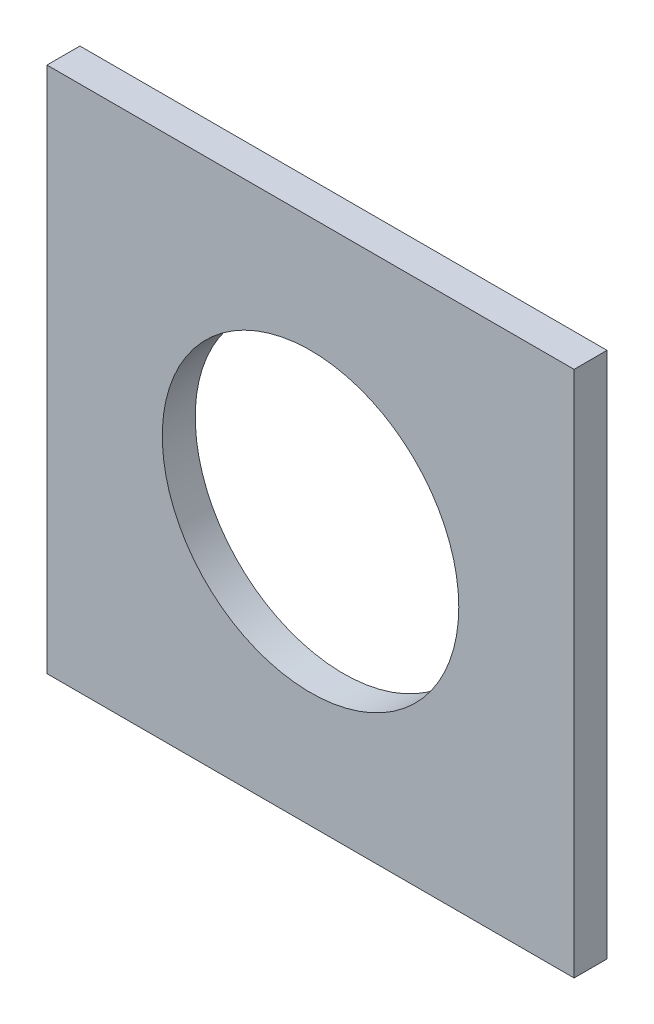
ISO-10303-21;
HEADER;
FILE_DESCRIPTION(('STEP AP214'),'2;1');
FILE_NAME('part.step','',(''),(''),'','','');
FILE_SCHEMA(('AUTOMOTIVE_DESIGN { 1 0 10303 214 1 1 1 1 }'));
ENDSEC;
DATA;
#1=APPLICATION_CONTEXT('core data for automotive mechanical design processes');
#2=APPLICATION_PROTOCOL_DEFINITION('international standard','automotive_design',2000,#1);
#3=PRODUCT_CONTEXT('',#1,'mechanical');
#4=PRODUCT('Part','Part','',(#3));
#5=PRODUCT_RELATED_PRODUCT_CATEGORY('part','',(#4));
#6=PRODUCT_DEFINITION_FORMATION('','',#4);
#7=PRODUCT_DEFINITION_CONTEXT('part definition',#1,'design');
#8=PRODUCT_DEFINITION('design','',#6,#7);
#9=PRODUCT_DEFINITION_SHAPE('','',#8);
#10=(LENGTH_UNIT() NAMED_UNIT(*) SI_UNIT(.MILLI.,.METRE.));
#11=(NAMED_UNIT(*) PLANE_ANGLE_UNIT() SI_UNIT($,.RADIAN.));
#12=(NAMED_UNIT(*) SI_UNIT($,.STERADIAN.) SOLID_ANGLE_UNIT());
#13=UNCERTAINTY_MEASURE_WITH_UNIT(LENGTH_MEASURE(1.E-05),#10,'distance_accuracy_value','');
#14=(GEOMETRIC_REPRESENTATION_CONTEXT(3) GLOBAL_UNCERTAINTY_ASSIGNED_CONTEXT((#13)) GLOBAL_UNIT_ASSIGNED_CONTEXT((#10,
#11,#12)) REPRESENTATION_CONTEXT('',''));
#15=CARTESIAN_POINT('',(0.,0.,0.));
#16=DIRECTION('',(0.,0.,1.));
#17=DIRECTION('',(1.,0.,0.));
#18=AXIS2_PLACEMENT_3D('',#15,#16,#17);
#19=CARTESIAN_POINT('',(-20.4568862275449,17.1107784431138,3.175));
#20=DIRECTION('',(1.,0.,0.));
#21=DIRECTION('',(0.,1.,0.));
#22=AXIS2_PLACEMENT_3D('',#19,#20,#21);
#23=PLANE('',#22);
#24=DIRECTION('',(0.,-1.,0.));
#25=VECTOR('',#24,1.);
#26=CARTESIAN_POINT('',(-20.4568862275449,17.1107784431138,0.));
#27=LINE('',#26,#25);
#28=CARTESIAN_POINT('',(-20.4568862275449,17.1107784431138,0.));
#29=VERTEX_POINT('',#28);
#30=CARTESIAN_POINT('',(-20.4568862275449,-33.6892215568862,0.));
#31=VERTEX_POINT('',#30);
#32=EDGE_CURVE('E96',#29,#31,#27,.T.);
#33=ORIENTED_EDGE('',*,*,#32,.T.);
#34=DIRECTION('',(0.,0.,-1.));
#35=VECTOR('',#34,1.);
#36=CARTESIAN_POINT('',(-20.4568862275449,-33.6892215568862,3.175));
#37=LINE('',#36,#35);
#38=CARTESIAN_POINT('',(-20.4568862275449,-33.6892215568862,3.175));
#39=VERTEX_POINT('',#38);
#40=EDGE_CURVE('E11',#39,#31,#37,.T.);
#41=ORIENTED_EDGE('',*,*,#40,.F.);
#42=DIRECTION('',(0.,-1.,0.));
#43=VECTOR('',#42,1.);
#44=CARTESIAN_POINT('',(-20.4568862275449,17.1107784431138,3.175));
#45=LINE('',#44,#43);
#46=CARTESIAN_POINT('',(-20.4568862275449,17.1107784431138,3.175));
#47=VERTEX_POINT('',#46);
#48=EDGE_CURVE('E84',#47,#39,#45,.T.);
#49=ORIENTED_EDGE('',*,*,#48,.F.);
#50=DIRECTION('',(0.,0.,-1.));
#51=VECTOR('',#50,1.);
#52=CARTESIAN_POINT('',(-20.4568862275449,17.1107784431138,3.175));
#53=LINE('',#52,#51);
#54=EDGE_CURVE('E92',#47,#29,#53,.T.);
#55=ORIENTED_EDGE('',*,*,#54,.T.);
#56=EDGE_LOOP('',(#33,#41,#49,#55));
#57=FACE_BOUND('',#56,.T.);
#58=ADVANCED_FACE('F33',(#57),#23,.F.);
#59=CARTESIAN_POINT('',(-20.4568862275449,-33.6892215568862,3.175));
#60=DIRECTION('',(0.,1.,0.));
#61=DIRECTION('',(0.,0.,1.));
#62=AXIS2_PLACEMENT_3D('',#59,#60,#61);
#63=PLANE('',#62);
#64=DIRECTION('',(1.,0.,0.));
#65=VECTOR('',#64,1.);
#66=CARTESIAN_POINT('',(-20.4568862275449,-33.6892215568862,0.));
#67=LINE('',#66,#65);
#68=CARTESIAN_POINT('',(30.3431137724551,-33.6892215568862,0.));
#69=VERTEX_POINT('',#68);
#70=EDGE_CURVE('E88',#31,#69,#67,.T.);
#71=ORIENTED_EDGE('',*,*,#70,.T.);
#72=DIRECTION('',(0.,0.,-1.));
#73=VECTOR('',#72,1.);
#74=CARTESIAN_POINT('',(30.3431137724551,-33.6892215568862,3.175));
#75=LINE('',#74,#73);
#76=CARTESIAN_POINT('',(30.3431137724551,-33.6892215568862,3.175));
#77=VERTEX_POINT('',#76);
#78=EDGE_CURVE('E41',#77,#69,#75,.T.);
#79=ORIENTED_EDGE('',*,*,#78,.F.);
#80=DIRECTION('',(1.,0.,0.));
#81=VECTOR('',#80,1.);
#82=CARTESIAN_POINT('',(-20.4568862275449,-33.6892215568862,3.175));
#83=LINE('',#82,#81);
#84=EDGE_CURVE('E79',#39,#77,#83,.T.);
#85=ORIENTED_EDGE('',*,*,#84,.F.);
#86=ORIENTED_EDGE('',*,*,#40,.T.);
#87=EDGE_LOOP('',(#71,#79,#85,#86));
#88=FACE_BOUND('',#87,.T.);
#89=ADVANCED_FACE('F87',(#88),#63,.F.);
#90=CARTESIAN_POINT('',(30.3431137724551,17.1107784431138,3.175));
#91=DIRECTION('',(-1.,0.,0.));
#92=DIRECTION('',(0.,-1.,0.));
#93=AXIS2_PLACEMENT_3D('',#90,#91,#92);
#94=PLANE('',#93);
#95=DIRECTION('',(0.,1.,0.));
#96=VECTOR('',#95,1.);
#97=CARTESIAN_POINT('',(30.3431137724551,17.1107784431138,0.));
#98=LINE('',#97,#96);
#99=CARTESIAN_POINT('',(30.3431137724551,17.1107784431138,0.));
#100=VERTEX_POINT('',#99);
#101=EDGE_CURVE('E66',#69,#100,#98,.T.);
#102=ORIENTED_EDGE('',*,*,#101,.T.);
#103=DIRECTION('',(0.,0.,-1.));
#104=VECTOR('',#103,1.);
#105=CARTESIAN_POINT('',(30.3431137724551,17.1107784431138,3.175));
#106=LINE('',#105,#104);
#107=CARTESIAN_POINT('',(30.3431137724551,17.1107784431138,3.175));
#108=VERTEX_POINT('',#107);
#109=EDGE_CURVE('E89',#108,#100,#106,.T.);
#110=ORIENTED_EDGE('',*,*,#109,.F.);
#111=DIRECTION('',(0.,1.,0.));
#112=VECTOR('',#111,1.);
#113=CARTESIAN_POINT('',(30.3431137724551,17.1107784431138,3.175));
#114=LINE('',#113,#112);
#115=EDGE_CURVE('E82',#77,#108,#114,.T.);
#116=ORIENTED_EDGE('',*,*,#115,.F.);
#117=ORIENTED_EDGE('',*,*,#78,.T.);
#118=EDGE_LOOP('',(#102,#110,#116,#117));
#119=FACE_BOUND('',#118,.T.);
#120=ADVANCED_FACE('F90',(#119),#94,.F.);
#121=CARTESIAN_POINT('',(-20.4568862275449,17.1107784431138,3.175));
#122=DIRECTION('',(0.,-1.,0.));
#123=DIRECTION('',(0.,0.,-1.));
#124=AXIS2_PLACEMENT_3D('',#121,#122,#123);
#125=PLANE('',#124);
#126=DIRECTION('',(-1.,0.,0.));
#127=VECTOR('',#126,1.);
#128=CARTESIAN_POINT('',(-20.4568862275449,17.1107784431138,0.));
#129=LINE('',#128,#127);
#130=EDGE_CURVE('E72',#100,#29,#129,.T.);
#131=ORIENTED_EDGE('',*,*,#130,.T.);
#132=ORIENTED_EDGE('',*,*,#54,.F.);
#133=DIRECTION('',(-1.,0.,0.));
#134=VECTOR('',#133,1.);
#135=CARTESIAN_POINT('',(-20.4568862275449,17.1107784431138,3.175));
#136=LINE('',#135,#134);
#137=EDGE_CURVE('E49',#108,#47,#136,.T.);
#138=ORIENTED_EDGE('',*,*,#137,.F.);
#139=ORIENTED_EDGE('',*,*,#109,.T.);
#140=EDGE_LOOP('',(#131,#132,#138,#139));
#141=FACE_BOUND('',#140,.T.);
#142=ADVANCED_FACE('F104',(#141),#125,.F.);
#143=CARTESIAN_POINT('',(0.,0.,3.175));
#144=DIRECTION('',(0.,0.,1.));
#145=DIRECTION('',(1.,0.,0.));
#146=AXIS2_PLACEMENT_3D('',#143,#144,#145);
#147=PLANE('',#146);
#148=CARTESIAN_POINT('',(4.9431137724551,-8.28922155688624,3.175));
#149=DIRECTION('',(0.,0.,1.));
#150=DIRECTION('',(1.,0.,0.));
#151=AXIS2_PLACEMENT_3D('',#148,#149,#150);
#152=CIRCLE('',#151,14.2875);
#153=CARTESIAN_POINT('',(19.2306137724551,-8.28922155688624,3.175));
#154=VERTEX_POINT('',#153);
#155=EDGE_CURVE('E110',#154,#154,#152,.T.);
#156=ORIENTED_EDGE('',*,*,#155,.F.);
#157=EDGE_LOOP('',(#156));
#158=FACE_BOUND('',#157,.T.);
#159=ORIENTED_EDGE('',*,*,#48,.T.);
#160=ORIENTED_EDGE('',*,*,#84,.T.);
#161=ORIENTED_EDGE('',*,*,#115,.T.);
#162=ORIENTED_EDGE('',*,*,#137,.T.);
#163=EDGE_LOOP('',(#159,#160,#161,#162));
#164=FACE_BOUND('',#163,.T.);
#165=ADVANCED_FACE('F80',(#158,#164),#147,.T.);
#166=CARTESIAN_POINT('',(0.,0.,0.));
#167=DIRECTION('',(0.,0.,1.));
#168=DIRECTION('',(1.,0.,0.));
#169=AXIS2_PLACEMENT_3D('',#166,#167,#168);
#170=PLANE('',#169);
#171=CARTESIAN_POINT('',(4.9431137724551,-8.28922155688624,0.));
#172=DIRECTION('',(0.,0.,1.));
#173=DIRECTION('',(1.,0.,0.));
#174=AXIS2_PLACEMENT_3D('',#171,#172,#173);
#175=CIRCLE('',#174,14.2875);
#176=CARTESIAN_POINT('',(19.2306137724551,-8.28922155688624,0.));
#177=VERTEX_POINT('',#176);
#178=EDGE_CURVE('E99',#177,#177,#175,.T.);
#179=ORIENTED_EDGE('',*,*,#178,.T.);
#180=EDGE_LOOP('',(#179));
#181=FACE_BOUND('',#180,.T.);
#182=ORIENTED_EDGE('',*,*,#32,.F.);
#183=ORIENTED_EDGE('',*,*,#130,.F.);
#184=ORIENTED_EDGE('',*,*,#101,.F.);
#185=ORIENTED_EDGE('',*,*,#70,.F.);
#186=EDGE_LOOP('',(#182,#183,#184,#185));
#187=FACE_BOUND('',#186,.T.);
#188=ADVANCED_FACE('F107',(#181,#187),#170,.F.);
#189=CARTESIAN_POINT('',(4.9431137724551,-8.28922155688624,0.));
#190=DIRECTION('',(0.,0.,1.));
#191=DIRECTION('',(1.,0.,0.));
#192=AXIS2_PLACEMENT_3D('',#189,#190,#191);
#193=CYLINDRICAL_SURFACE('',#192,14.2875);
#194=ORIENTED_EDGE('',*,*,#178,.F.);
#195=EDGE_LOOP('',(#194));
#196=FACE_BOUND('',#195,.T.);
#197=ORIENTED_EDGE('',*,*,#155,.T.);
#198=EDGE_LOOP('',(#197));
#199=FACE_BOUND('',#198,.T.);
#200=ADVANCED_FACE('F117',(#196,#199),#193,.F.);
#201=CLOSED_SHELL('',(#58,#89,#120,#142,#165,#188,#200));
#202=MANIFOLD_SOLID_BREP('B2',#201);
#203=ADVANCED_BREP_SHAPE_REPRESENTATION('',(#18,#202),#14);
#204=SHAPE_DEFINITION_REPRESENTATION(#9,#203);
ENDSEC;
END-ISO-10303-21;
